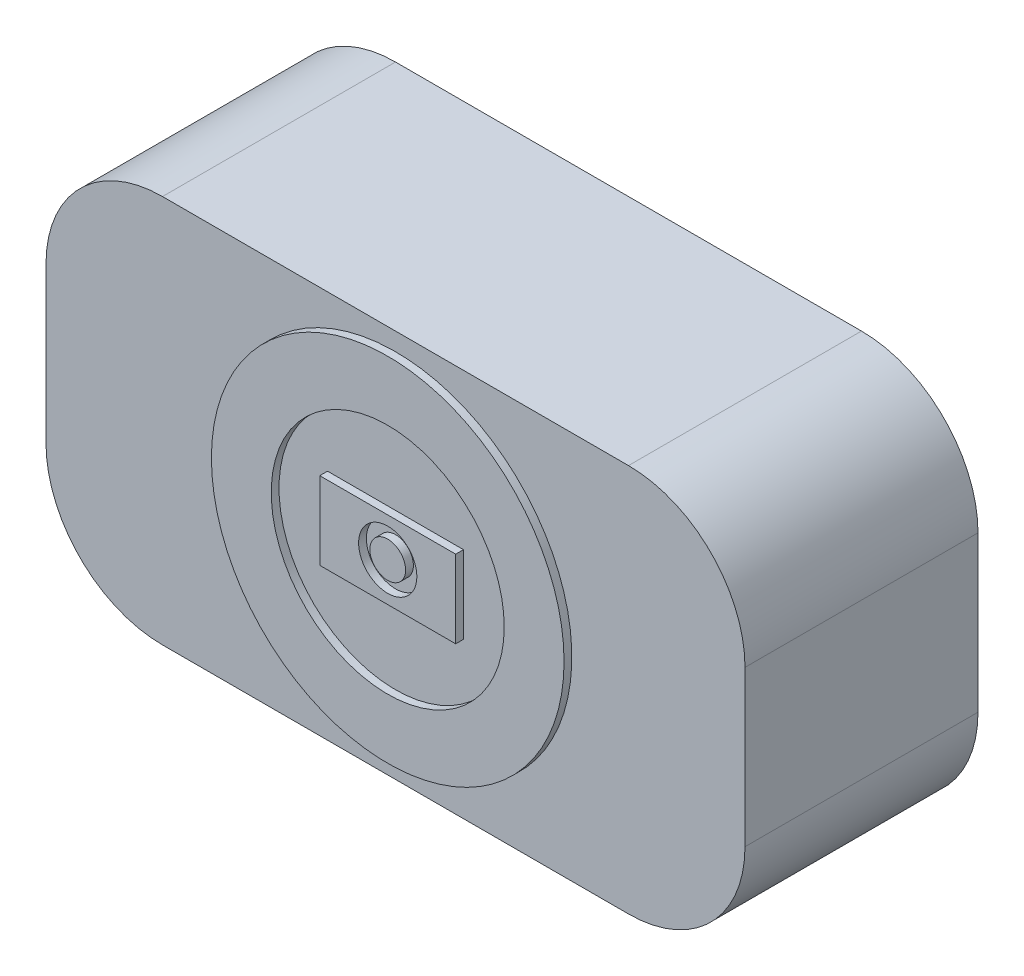
ISO-10303-21;
HEADER;
FILE_DESCRIPTION(('STEP AP214'),'2;1');
FILE_NAME('part.step','',(''),(''),'','','');
FILE_SCHEMA(('AUTOMOTIVE_DESIGN { 1 0 10303 214 1 1 1 1 }'));
ENDSEC;
DATA;
#1=APPLICATION_CONTEXT('core data for automotive mechanical design processes');
#2=APPLICATION_PROTOCOL_DEFINITION('international standard','automotive_design',2000,#1);
#3=PRODUCT_CONTEXT('',#1,'mechanical');
#4=PRODUCT('Part','Part','',(#3));
#5=PRODUCT_RELATED_PRODUCT_CATEGORY('part','',(#4));
#6=PRODUCT_DEFINITION_FORMATION('','',#4);
#7=PRODUCT_DEFINITION_CONTEXT('part definition',#1,'design');
#8=PRODUCT_DEFINITION('design','',#6,#7);
#9=PRODUCT_DEFINITION_SHAPE('','',#8);
#10=(LENGTH_UNIT() NAMED_UNIT(*) SI_UNIT(.MILLI.,.METRE.));
#11=(NAMED_UNIT(*) PLANE_ANGLE_UNIT() SI_UNIT($,.RADIAN.));
#12=(NAMED_UNIT(*) SI_UNIT($,.STERADIAN.) SOLID_ANGLE_UNIT());
#13=UNCERTAINTY_MEASURE_WITH_UNIT(LENGTH_MEASURE(1.E-05),#10,'distance_accuracy_value','');
#14=(GEOMETRIC_REPRESENTATION_CONTEXT(3) GLOBAL_UNCERTAINTY_ASSIGNED_CONTEXT((#13)) GLOBAL_UNIT_ASSIGNED_CONTEXT((#10,
#11,#12)) REPRESENTATION_CONTEXT('',''));
#15=CARTESIAN_POINT('',(0.,0.,0.));
#16=DIRECTION('',(0.,0.,1.));
#17=DIRECTION('',(1.,0.,0.));
#18=AXIS2_PLACEMENT_3D('',#15,#16,#17);
#19=CARTESIAN_POINT('',(45.,25.,0.));
#20=DIRECTION('',(0.,0.,1.));
#21=DIRECTION('',(1.,0.,0.));
#22=AXIS2_PLACEMENT_3D('',#19,#20,#21);
#23=PLANE('',#22);
#24=CARTESIAN_POINT('',(45.,25.,0.));
#25=DIRECTION('',(0.,0.,1.));
#26=DIRECTION('',(1.,0.,0.));
#27=AXIS2_PLACEMENT_3D('',#24,#25,#26);
#28=CIRCLE('',#27,3.75000000000001);
#29=CARTESIAN_POINT('',(48.75,25.,0.));
#30=VERTEX_POINT('',#29);
#31=EDGE_CURVE('E432',#30,#30,#28,.T.);
#32=ORIENTED_EDGE('',*,*,#31,.T.);
#33=EDGE_LOOP('',(#32));
#34=FACE_BOUND('',#33,.T.);
#35=CARTESIAN_POINT('',(45.,25.,0.));
#36=DIRECTION('',(0.,0.,1.));
#37=DIRECTION('',(1.,0.,0.));
#38=AXIS2_PLACEMENT_3D('',#35,#36,#37);
#39=CIRCLE('',#38,2.30333071039238);
#40=CARTESIAN_POINT('',(47.3033307103924,25.,0.));
#41=VERTEX_POINT('',#40);
#42=EDGE_CURVE('E429',#41,#41,#39,.T.);
#43=ORIENTED_EDGE('',*,*,#42,.F.);
#44=EDGE_LOOP('',(#43));
#45=FACE_BOUND('',#44,.T.);
#46=ADVANCED_FACE('F32',(#34,#45),#23,.T.);
#47=CARTESIAN_POINT('',(45.,25.,0.));
#48=DIRECTION('',(0.,0.,1.));
#49=DIRECTION('',(1.,0.,0.));
#50=AXIS2_PLACEMENT_3D('',#47,#48,#49);
#51=PLANE('',#50);
#52=CARTESIAN_POINT('',(45.,25.,0.));
#53=DIRECTION('',(0.,0.,1.));
#54=DIRECTION('',(1.,0.,0.));
#55=AXIS2_PLACEMENT_3D('',#52,#53,#54);
#56=CIRCLE('',#55,15.);
#57=CARTESIAN_POINT('',(60.,25.,0.));
#58=VERTEX_POINT('',#57);
#59=EDGE_CURVE('E151',#58,#58,#56,.T.);
#60=ORIENTED_EDGE('',*,*,#59,.T.);
#61=EDGE_LOOP('',(#60));
#62=FACE_BOUND('',#61,.T.);
#63=DIRECTION('',(1.,0.,0.));
#64=VECTOR('',#63,1.);
#65=CARTESIAN_POINT('',(36.25,20.,0.));
#66=LINE('',#65,#64);
#67=CARTESIAN_POINT('',(36.25,20.,0.));
#68=VERTEX_POINT('',#67);
#69=CARTESIAN_POINT('',(53.75,20.,0.));
#70=VERTEX_POINT('',#69);
#71=EDGE_CURVE('E442',#68,#70,#66,.T.);
#72=ORIENTED_EDGE('',*,*,#71,.F.);
#73=DIRECTION('',(0.,-1.,0.));
#74=VECTOR('',#73,1.);
#75=CARTESIAN_POINT('',(36.25,20.,0.));
#76=LINE('',#75,#74);
#77=CARTESIAN_POINT('',(36.25,30.,0.));
#78=VERTEX_POINT('',#77);
#79=EDGE_CURVE('E146',#78,#68,#76,.T.);
#80=ORIENTED_EDGE('',*,*,#79,.F.);
#81=DIRECTION('',(-1.,0.,0.));
#82=VECTOR('',#81,1.);
#83=CARTESIAN_POINT('',(36.25,30.,0.));
#84=LINE('',#83,#82);
#85=CARTESIAN_POINT('',(53.75,30.,0.));
#86=VERTEX_POINT('',#85);
#87=EDGE_CURVE('E142',#86,#78,#84,.T.);
#88=ORIENTED_EDGE('',*,*,#87,.F.);
#89=DIRECTION('',(0.,1.,0.));
#90=VECTOR('',#89,1.);
#91=CARTESIAN_POINT('',(53.75,20.,0.));
#92=LINE('',#91,#90);
#93=EDGE_CURVE('E444',#70,#86,#92,.T.);
#94=ORIENTED_EDGE('',*,*,#93,.F.);
#95=EDGE_LOOP('',(#72,#80,#88,#94));
#96=FACE_BOUND('',#95,.T.);
#97=ADVANCED_FACE('F260',(#62,#96),#51,.T.);
#98=CARTESIAN_POINT('',(0.,0.,0.));
#99=DIRECTION('',(0.,0.,-1.));
#100=DIRECTION('',(-1.,0.,0.));
#101=AXIS2_PLACEMENT_3D('',#98,#99,#100);
#102=PLANE('',#101);
#103=DIRECTION('',(1.,0.,0.));
#104=VECTOR('',#103,1.);
#105=CARTESIAN_POINT('',(0.,0.,0.));
#106=LINE('',#105,#104);
#107=CARTESIAN_POINT('',(15.,0.,0.));
#108=VERTEX_POINT('',#107);
#109=CARTESIAN_POINT('',(75.,0.,0.));
#110=VERTEX_POINT('',#109);
#111=EDGE_CURVE('E177',#108,#110,#106,.T.);
#112=ORIENTED_EDGE('',*,*,#111,.T.);
#113=CARTESIAN_POINT('',(75.,15.,0.));
#114=DIRECTION('',(0.,0.,-1.));
#115=DIRECTION('',(-1.,0.,0.));
#116=AXIS2_PLACEMENT_3D('',#113,#114,#115);
#117=CIRCLE('',#116,15.);
#118=CARTESIAN_POINT('',(90.,15.,0.));
#119=VERTEX_POINT('',#118);
#120=EDGE_CURVE('E195',#110,#119,#117,.F.);
#121=ORIENTED_EDGE('',*,*,#120,.T.);
#122=DIRECTION('',(0.,1.,0.));
#123=VECTOR('',#122,1.);
#124=CARTESIAN_POINT('',(90.,0.,0.));
#125=LINE('',#124,#123);
#126=CARTESIAN_POINT('',(90.,35.,0.));
#127=VERTEX_POINT('',#126);
#128=EDGE_CURVE('E180',#119,#127,#125,.T.);
#129=ORIENTED_EDGE('',*,*,#128,.T.);
#130=CARTESIAN_POINT('',(75.,35.,0.));
#131=DIRECTION('',(0.,0.,-1.));
#132=DIRECTION('',(-1.,0.,0.));
#133=AXIS2_PLACEMENT_3D('',#130,#131,#132);
#134=CIRCLE('',#133,15.);
#135=CARTESIAN_POINT('',(75.,50.,0.));
#136=VERTEX_POINT('',#135);
#137=EDGE_CURVE('E189',#127,#136,#134,.F.);
#138=ORIENTED_EDGE('',*,*,#137,.T.);
#139=DIRECTION('',(-1.,0.,0.));
#140=VECTOR('',#139,1.);
#141=CARTESIAN_POINT('',(0.,50.,0.));
#142=LINE('',#141,#140);
#143=CARTESIAN_POINT('',(15.,50.,0.));
#144=VERTEX_POINT('',#143);
#145=EDGE_CURVE('E166',#136,#144,#142,.T.);
#146=ORIENTED_EDGE('',*,*,#145,.T.);
#147=CARTESIAN_POINT('',(15.,35.,0.));
#148=DIRECTION('',(0.,0.,-1.));
#149=DIRECTION('',(-1.,0.,0.));
#150=AXIS2_PLACEMENT_3D('',#147,#148,#149);
#151=CIRCLE('',#150,15.);
#152=CARTESIAN_POINT('',(0.,35.,0.));
#153=VERTEX_POINT('',#152);
#154=EDGE_CURVE('E191',#144,#153,#151,.F.);
#155=ORIENTED_EDGE('',*,*,#154,.T.);
#156=DIRECTION('',(0.,-1.,0.));
#157=VECTOR('',#156,1.);
#158=CARTESIAN_POINT('',(0.,0.,0.));
#159=LINE('',#158,#157);
#160=CARTESIAN_POINT('',(0.,15.,0.));
#161=VERTEX_POINT('',#160);
#162=EDGE_CURVE('E161',#153,#161,#159,.T.);
#163=ORIENTED_EDGE('',*,*,#162,.T.);
#164=CARTESIAN_POINT('',(15.,15.,0.));
#165=DIRECTION('',(0.,0.,-1.));
#166=DIRECTION('',(-1.,0.,0.));
#167=AXIS2_PLACEMENT_3D('',#164,#165,#166);
#168=CIRCLE('',#167,15.);
#169=EDGE_CURVE('E193',#161,#108,#168,.F.);
#170=ORIENTED_EDGE('',*,*,#169,.T.);
#171=EDGE_LOOP('',(#112,#121,#129,#138,#146,#155,#163,#170));
#172=FACE_BOUND('',#171,.T.);
#173=CARTESIAN_POINT('',(45.,25.,0.));
#174=DIRECTION('',(0.,0.,-1.));
#175=DIRECTION('',(-1.,0.,0.));
#176=AXIS2_PLACEMENT_3D('',#173,#174,#175);
#177=CIRCLE('',#176,22.703438641427);
#178=CARTESIAN_POINT('',(22.296561358573,25.,0.));
#179=VERTEX_POINT('',#178);
#180=EDGE_CURVE('E11',#179,#179,#177,.F.);
#181=ORIENTED_EDGE('',*,*,#180,.F.);
#182=EDGE_LOOP('',(#181));
#183=FACE_BOUND('',#182,.T.);
#184=ADVANCED_FACE('F223',(#172,#183),#102,.F.);
#185=CARTESIAN_POINT('',(0.,0.,-30.));
#186=DIRECTION('',(-1.,0.,0.));
#187=DIRECTION('',(0.,0.,1.));
#188=AXIS2_PLACEMENT_3D('',#185,#186,#187);
#189=PLANE('',#188);
#190=DIRECTION('',(0.,-1.,0.));
#191=VECTOR('',#190,1.);
#192=CARTESIAN_POINT('',(0.,0.,-30.));
#193=LINE('',#192,#191);
#194=CARTESIAN_POINT('',(0.,35.,-30.));
#195=VERTEX_POINT('',#194);
#196=CARTESIAN_POINT('',(0.,15.,-30.));
#197=VERTEX_POINT('',#196);
#198=EDGE_CURVE('E162',#195,#197,#193,.T.);
#199=ORIENTED_EDGE('',*,*,#198,.T.);
#200=DIRECTION('',(0.,0.,1.));
#201=VECTOR('',#200,1.);
#202=CARTESIAN_POINT('',(0.,15.,-30.));
#203=LINE('',#202,#201);
#204=EDGE_CURVE('E211',#197,#161,#203,.T.);
#205=ORIENTED_EDGE('',*,*,#204,.T.);
#206=ORIENTED_EDGE('',*,*,#162,.F.);
#207=DIRECTION('',(0.,0.,1.));
#208=VECTOR('',#207,1.);
#209=CARTESIAN_POINT('',(0.,35.,-30.));
#210=LINE('',#209,#208);
#211=EDGE_CURVE('E209',#153,#195,#210,.F.);
#212=ORIENTED_EDGE('',*,*,#211,.T.);
#213=EDGE_LOOP('',(#199,#205,#206,#212));
#214=FACE_BOUND('',#213,.T.);
#215=ADVANCED_FACE('F249',(#214),#189,.T.);
#216=CARTESIAN_POINT('',(0.,50.,-30.));
#217=DIRECTION('',(0.,1.,0.));
#218=DIRECTION('',(0.,0.,1.));
#219=AXIS2_PLACEMENT_3D('',#216,#217,#218);
#220=PLANE('',#219);
#221=DIRECTION('',(-1.,0.,0.));
#222=VECTOR('',#221,1.);
#223=CARTESIAN_POINT('',(0.,50.,-30.));
#224=LINE('',#223,#222);
#225=CARTESIAN_POINT('',(75.,50.,-30.));
#226=VERTEX_POINT('',#225);
#227=CARTESIAN_POINT('',(15.,50.,-30.));
#228=VERTEX_POINT('',#227);
#229=EDGE_CURVE('E172',#226,#228,#224,.T.);
#230=ORIENTED_EDGE('',*,*,#229,.T.);
#231=DIRECTION('',(0.,0.,1.));
#232=VECTOR('',#231,1.);
#233=CARTESIAN_POINT('',(15.,50.,-30.));
#234=LINE('',#233,#232);
#235=EDGE_CURVE('E40',#228,#144,#234,.T.);
#236=ORIENTED_EDGE('',*,*,#235,.T.);
#237=ORIENTED_EDGE('',*,*,#145,.F.);
#238=DIRECTION('',(0.,0.,1.));
#239=VECTOR('',#238,1.);
#240=CARTESIAN_POINT('',(75.,50.,-30.));
#241=LINE('',#240,#239);
#242=EDGE_CURVE('E214',#136,#226,#241,.F.);
#243=ORIENTED_EDGE('',*,*,#242,.T.);
#244=EDGE_LOOP('',(#230,#236,#237,#243));
#245=FACE_BOUND('',#244,.T.);
#246=ADVANCED_FACE('F219',(#245),#220,.T.);
#247=CARTESIAN_POINT('',(90.,0.,-30.));
#248=DIRECTION('',(1.,0.,0.));
#249=DIRECTION('',(0.,0.,-1.));
#250=AXIS2_PLACEMENT_3D('',#247,#248,#249);
#251=PLANE('',#250);
#252=ORIENTED_EDGE('',*,*,#128,.F.);
#253=DIRECTION('',(0.,0.,1.));
#254=VECTOR('',#253,1.);
#255=CARTESIAN_POINT('',(90.,15.,-30.));
#256=LINE('',#255,#254);
#257=CARTESIAN_POINT('',(90.,15.,-30.));
#258=VERTEX_POINT('',#257);
#259=EDGE_CURVE('E200',#119,#258,#256,.F.);
#260=ORIENTED_EDGE('',*,*,#259,.T.);
#261=DIRECTION('',(0.,1.,0.));
#262=VECTOR('',#261,1.);
#263=CARTESIAN_POINT('',(90.,0.,-30.));
#264=LINE('',#263,#262);
#265=CARTESIAN_POINT('',(90.,35.,-30.));
#266=VERTEX_POINT('',#265);
#267=EDGE_CURVE('E169',#258,#266,#264,.T.);
#268=ORIENTED_EDGE('',*,*,#267,.T.);
#269=DIRECTION('',(0.,0.,1.));
#270=VECTOR('',#269,1.);
#271=CARTESIAN_POINT('',(90.,35.,-30.));
#272=LINE('',#271,#270);
#273=EDGE_CURVE('E197',#266,#127,#272,.T.);
#274=ORIENTED_EDGE('',*,*,#273,.T.);
#275=EDGE_LOOP('',(#252,#260,#268,#274));
#276=FACE_BOUND('',#275,.T.);
#277=ADVANCED_FACE('F231',(#276),#251,.T.);
#278=CARTESIAN_POINT('',(0.,0.,-30.));
#279=DIRECTION('',(0.,-1.,0.));
#280=DIRECTION('',(0.,0.,-1.));
#281=AXIS2_PLACEMENT_3D('',#278,#279,#280);
#282=PLANE('',#281);
#283=DIRECTION('',(1.,0.,0.));
#284=VECTOR('',#283,1.);
#285=CARTESIAN_POINT('',(0.,0.,-30.));
#286=LINE('',#285,#284);
#287=CARTESIAN_POINT('',(15.,0.,-30.));
#288=VERTEX_POINT('',#287);
#289=CARTESIAN_POINT('',(75.,0.,-30.));
#290=VERTEX_POINT('',#289);
#291=EDGE_CURVE('E165',#288,#290,#286,.T.);
#292=ORIENTED_EDGE('',*,*,#291,.T.);
#293=DIRECTION('',(0.,0.,1.));
#294=VECTOR('',#293,1.);
#295=CARTESIAN_POINT('',(75.,0.,-30.));
#296=LINE('',#295,#294);
#297=EDGE_CURVE('E186',#290,#110,#296,.T.);
#298=ORIENTED_EDGE('',*,*,#297,.T.);
#299=ORIENTED_EDGE('',*,*,#111,.F.);
#300=DIRECTION('',(0.,0.,1.));
#301=VECTOR('',#300,1.);
#302=CARTESIAN_POINT('',(15.,0.,-30.));
#303=LINE('',#302,#301);
#304=EDGE_CURVE('E174',#108,#288,#303,.F.);
#305=ORIENTED_EDGE('',*,*,#304,.T.);
#306=EDGE_LOOP('',(#292,#298,#299,#305));
#307=FACE_BOUND('',#306,.T.);
#308=ADVANCED_FACE('F242',(#307),#282,.T.);
#309=CARTESIAN_POINT('',(0.,0.,-30.));
#310=DIRECTION('',(0.,0.,-1.));
#311=DIRECTION('',(-1.,0.,0.));
#312=AXIS2_PLACEMENT_3D('',#309,#310,#311);
#313=PLANE('',#312);
#314=ORIENTED_EDGE('',*,*,#267,.F.);
#315=CARTESIAN_POINT('',(75.,15.,-30.));
#316=DIRECTION('',(0.,0.,-1.));
#317=DIRECTION('',(-1.,0.,0.));
#318=AXIS2_PLACEMENT_3D('',#315,#316,#317);
#319=CIRCLE('',#318,15.);
#320=EDGE_CURVE('E207',#258,#290,#319,.T.);
#321=ORIENTED_EDGE('',*,*,#320,.T.);
#322=ORIENTED_EDGE('',*,*,#291,.F.);
#323=CARTESIAN_POINT('',(15.,15.,-30.));
#324=DIRECTION('',(0.,0.,-1.));
#325=DIRECTION('',(-1.,0.,0.));
#326=AXIS2_PLACEMENT_3D('',#323,#324,#325);
#327=CIRCLE('',#326,15.);
#328=EDGE_CURVE('E205',#288,#197,#327,.T.);
#329=ORIENTED_EDGE('',*,*,#328,.T.);
#330=ORIENTED_EDGE('',*,*,#198,.F.);
#331=CARTESIAN_POINT('',(15.,35.,-30.));
#332=DIRECTION('',(0.,0.,-1.));
#333=DIRECTION('',(-1.,0.,0.));
#334=AXIS2_PLACEMENT_3D('',#331,#332,#333);
#335=CIRCLE('',#334,15.);
#336=EDGE_CURVE('E55',#195,#228,#335,.T.);
#337=ORIENTED_EDGE('',*,*,#336,.T.);
#338=ORIENTED_EDGE('',*,*,#229,.F.);
#339=CARTESIAN_POINT('',(75.,35.,-30.));
#340=DIRECTION('',(0.,0.,-1.));
#341=DIRECTION('',(-1.,0.,0.));
#342=AXIS2_PLACEMENT_3D('',#339,#340,#341);
#343=CIRCLE('',#342,15.);
#344=EDGE_CURVE('E202',#226,#266,#343,.T.);
#345=ORIENTED_EDGE('',*,*,#344,.T.);
#346=EDGE_LOOP('',(#314,#321,#322,#329,#330,#337,#338,#345));
#347=FACE_BOUND('',#346,.T.);
#348=ADVANCED_FACE('F235',(#347),#313,.T.);
#349=CARTESIAN_POINT('',(75.,15.,-30.));
#350=DIRECTION('',(0.,0.,1.));
#351=DIRECTION('',(1.,0.,0.));
#352=AXIS2_PLACEMENT_3D('',#349,#350,#351);
#353=CYLINDRICAL_SURFACE('',#352,15.);
#354=ORIENTED_EDGE('',*,*,#320,.F.);
#355=ORIENTED_EDGE('',*,*,#259,.F.);
#356=ORIENTED_EDGE('',*,*,#120,.F.);
#357=ORIENTED_EDGE('',*,*,#297,.F.);
#358=EDGE_LOOP('',(#354,#355,#356,#357));
#359=FACE_BOUND('',#358,.T.);
#360=ADVANCED_FACE('F239',(#359),#353,.T.);
#361=CARTESIAN_POINT('',(15.,15.,-30.));
#362=DIRECTION('',(0.,0.,1.));
#363=DIRECTION('',(1.,0.,0.));
#364=AXIS2_PLACEMENT_3D('',#361,#362,#363);
#365=CYLINDRICAL_SURFACE('',#364,15.);
#366=ORIENTED_EDGE('',*,*,#328,.F.);
#367=ORIENTED_EDGE('',*,*,#304,.F.);
#368=ORIENTED_EDGE('',*,*,#169,.F.);
#369=ORIENTED_EDGE('',*,*,#204,.F.);
#370=EDGE_LOOP('',(#366,#367,#368,#369));
#371=FACE_BOUND('',#370,.T.);
#372=ADVANCED_FACE('F247',(#371),#365,.T.);
#373=CARTESIAN_POINT('',(15.,35.,-30.));
#374=DIRECTION('',(0.,0.,1.));
#375=DIRECTION('',(1.,0.,0.));
#376=AXIS2_PLACEMENT_3D('',#373,#374,#375);
#377=CYLINDRICAL_SURFACE('',#376,15.);
#378=ORIENTED_EDGE('',*,*,#336,.F.);
#379=ORIENTED_EDGE('',*,*,#211,.F.);
#380=ORIENTED_EDGE('',*,*,#154,.F.);
#381=ORIENTED_EDGE('',*,*,#235,.F.);
#382=EDGE_LOOP('',(#378,#379,#380,#381));
#383=FACE_BOUND('',#382,.T.);
#384=ADVANCED_FACE('F251',(#383),#377,.T.);
#385=CARTESIAN_POINT('',(75.,35.,-30.));
#386=DIRECTION('',(0.,0.,1.));
#387=DIRECTION('',(1.,0.,0.));
#388=AXIS2_PLACEMENT_3D('',#385,#386,#387);
#389=CYLINDRICAL_SURFACE('',#388,15.);
#390=ORIENTED_EDGE('',*,*,#344,.F.);
#391=ORIENTED_EDGE('',*,*,#242,.F.);
#392=ORIENTED_EDGE('',*,*,#137,.F.);
#393=ORIENTED_EDGE('',*,*,#273,.F.);
#394=EDGE_LOOP('',(#390,#391,#392,#393));
#395=FACE_BOUND('',#394,.T.);
#396=ADVANCED_FACE('F34',(#395),#389,.T.);
#397=CARTESIAN_POINT('',(45.,25.,1.));
#398=DIRECTION('',(0.,0.,-1.));
#399=DIRECTION('',(-1.,0.,0.));
#400=AXIS2_PLACEMENT_3D('',#397,#398,#399);
#401=CYLINDRICAL_SURFACE('',#400,22.703438641427);
#402=CARTESIAN_POINT('',(45.,25.,1.));
#403=DIRECTION('',(0.,0.,1.));
#404=DIRECTION('',(1.,0.,0.));
#405=AXIS2_PLACEMENT_3D('',#402,#403,#404);
#406=CIRCLE('',#405,22.703438641427);
#407=CARTESIAN_POINT('',(67.7034386414269,25.,1.));
#408=VERTEX_POINT('',#407);
#409=EDGE_CURVE('E157',#408,#408,#406,.T.);
#410=ORIENTED_EDGE('',*,*,#409,.F.);
#411=EDGE_LOOP('',(#410));
#412=FACE_BOUND('',#411,.T.);
#413=ORIENTED_EDGE('',*,*,#180,.T.);
#414=EDGE_LOOP('',(#413));
#415=FACE_BOUND('',#414,.T.);
#416=ADVANCED_FACE('F257',(#412,#415),#401,.T.);
#417=CARTESIAN_POINT('',(45.,25.,1.));
#418=DIRECTION('',(0.,0.,1.));
#419=DIRECTION('',(1.,0.,0.));
#420=AXIS2_PLACEMENT_3D('',#417,#418,#419);
#421=PLANE('',#420);
#422=CARTESIAN_POINT('',(45.,25.,1.));
#423=DIRECTION('',(0.,0.,1.));
#424=DIRECTION('',(1.,0.,0.));
#425=AXIS2_PLACEMENT_3D('',#422,#423,#424);
#426=CIRCLE('',#425,15.);
#427=CARTESIAN_POINT('',(60.,25.,1.));
#428=VERTEX_POINT('',#427);
#429=EDGE_CURVE('E148',#428,#428,#426,.T.);
#430=ORIENTED_EDGE('',*,*,#429,.F.);
#431=EDGE_LOOP('',(#430));
#432=FACE_BOUND('',#431,.T.);
#433=ORIENTED_EDGE('',*,*,#409,.T.);
#434=EDGE_LOOP('',(#433));
#435=FACE_BOUND('',#434,.T.);
#436=ADVANCED_FACE('F295',(#432,#435),#421,.T.);
#437=CARTESIAN_POINT('',(45.,25.,0.));
#438=DIRECTION('',(0.,0.,1.));
#439=DIRECTION('',(1.,0.,0.));
#440=AXIS2_PLACEMENT_3D('',#437,#438,#439);
#441=CYLINDRICAL_SURFACE('',#440,15.);
#442=ORIENTED_EDGE('',*,*,#59,.F.);
#443=EDGE_LOOP('',(#442));
#444=FACE_BOUND('',#443,.T.);
#445=ORIENTED_EDGE('',*,*,#429,.T.);
#446=EDGE_LOOP('',(#445));
#447=FACE_BOUND('',#446,.T.);
#448=ADVANCED_FACE('F291',(#444,#447),#441,.F.);
#449=CARTESIAN_POINT('',(36.25,20.,1.));
#450=DIRECTION('',(1.,0.,0.));
#451=DIRECTION('',(0.,0.,-1.));
#452=AXIS2_PLACEMENT_3D('',#449,#450,#451);
#453=PLANE('',#452);
#454=ORIENTED_EDGE('',*,*,#79,.T.);
#455=DIRECTION('',(0.,0.,-1.));
#456=VECTOR('',#455,1.);
#457=CARTESIAN_POINT('',(36.25,20.,1.));
#458=LINE('',#457,#456);
#459=CARTESIAN_POINT('',(36.25,20.,1.));
#460=VERTEX_POINT('',#459);
#461=EDGE_CURVE('E127',#460,#68,#458,.T.);
#462=ORIENTED_EDGE('',*,*,#461,.F.);
#463=DIRECTION('',(0.,-1.,0.));
#464=VECTOR('',#463,1.);
#465=CARTESIAN_POINT('',(36.25,20.,1.));
#466=LINE('',#465,#464);
#467=CARTESIAN_POINT('',(36.25,30.,1.));
#468=VERTEX_POINT('',#467);
#469=EDGE_CURVE('E134',#468,#460,#466,.T.);
#470=ORIENTED_EDGE('',*,*,#469,.F.);
#471=DIRECTION('',(0.,0.,-1.));
#472=VECTOR('',#471,1.);
#473=CARTESIAN_POINT('',(36.25,30.,1.));
#474=LINE('',#473,#472);
#475=EDGE_CURVE('E440',#468,#78,#474,.T.);
#476=ORIENTED_EDGE('',*,*,#475,.T.);
#477=EDGE_LOOP('',(#454,#462,#470,#476));
#478=FACE_BOUND('',#477,.T.);
#479=ADVANCED_FACE('F144',(#478),#453,.F.);
#480=CARTESIAN_POINT('',(36.25,20.,1.));
#481=DIRECTION('',(0.,1.,0.));
#482=DIRECTION('',(0.,0.,1.));
#483=AXIS2_PLACEMENT_3D('',#480,#481,#482);
#484=PLANE('',#483);
#485=ORIENTED_EDGE('',*,*,#71,.T.);
#486=DIRECTION('',(0.,0.,-1.));
#487=VECTOR('',#486,1.);
#488=CARTESIAN_POINT('',(53.75,20.,1.));
#489=LINE('',#488,#487);
#490=CARTESIAN_POINT('',(53.75,20.,1.));
#491=VERTEX_POINT('',#490);
#492=EDGE_CURVE('E130',#491,#70,#489,.T.);
#493=ORIENTED_EDGE('',*,*,#492,.F.);
#494=DIRECTION('',(1.,0.,0.));
#495=VECTOR('',#494,1.);
#496=CARTESIAN_POINT('',(36.25,20.,1.));
#497=LINE('',#496,#495);
#498=EDGE_CURVE('E123',#460,#491,#497,.T.);
#499=ORIENTED_EDGE('',*,*,#498,.F.);
#500=ORIENTED_EDGE('',*,*,#461,.T.);
#501=EDGE_LOOP('',(#485,#493,#499,#500));
#502=FACE_BOUND('',#501,.T.);
#503=ADVANCED_FACE('F125',(#502),#484,.F.);
#504=CARTESIAN_POINT('',(53.75,20.,1.));
#505=DIRECTION('',(-1.,0.,0.));
#506=DIRECTION('',(0.,0.,1.));
#507=AXIS2_PLACEMENT_3D('',#504,#505,#506);
#508=PLANE('',#507);
#509=ORIENTED_EDGE('',*,*,#93,.T.);
#510=DIRECTION('',(0.,0.,-1.));
#511=VECTOR('',#510,1.);
#512=CARTESIAN_POINT('',(53.75,30.,1.));
#513=LINE('',#512,#511);
#514=CARTESIAN_POINT('',(53.75,30.,1.));
#515=VERTEX_POINT('',#514);
#516=EDGE_CURVE('E47',#515,#86,#513,.T.);
#517=ORIENTED_EDGE('',*,*,#516,.F.);
#518=DIRECTION('',(0.,1.,0.));
#519=VECTOR('',#518,1.);
#520=CARTESIAN_POINT('',(53.75,20.,1.));
#521=LINE('',#520,#519);
#522=EDGE_CURVE('E133',#491,#515,#521,.T.);
#523=ORIENTED_EDGE('',*,*,#522,.F.);
#524=ORIENTED_EDGE('',*,*,#492,.T.);
#525=EDGE_LOOP('',(#509,#517,#523,#524));
#526=FACE_BOUND('',#525,.T.);
#527=ADVANCED_FACE('F284',(#526),#508,.F.);
#528=CARTESIAN_POINT('',(36.25,30.,1.));
#529=DIRECTION('',(0.,-1.,0.));
#530=DIRECTION('',(1.,0.,0.));
#531=AXIS2_PLACEMENT_3D('',#528,#529,#530);
#532=PLANE('',#531);
#533=ORIENTED_EDGE('',*,*,#87,.T.);
#534=ORIENTED_EDGE('',*,*,#475,.F.);
#535=DIRECTION('',(-1.,0.,0.));
#536=VECTOR('',#535,1.);
#537=CARTESIAN_POINT('',(36.25,30.,1.));
#538=LINE('',#537,#536);
#539=EDGE_CURVE('E138',#515,#468,#538,.T.);
#540=ORIENTED_EDGE('',*,*,#539,.F.);
#541=ORIENTED_EDGE('',*,*,#516,.T.);
#542=EDGE_LOOP('',(#533,#534,#540,#541));
#543=FACE_BOUND('',#542,.T.);
#544=ADVANCED_FACE('F280',(#543),#532,.F.);
#545=CARTESIAN_POINT('',(0.,0.,1.));
#546=DIRECTION('',(0.,0.,-1.));
#547=DIRECTION('',(-1.,0.,0.));
#548=AXIS2_PLACEMENT_3D('',#545,#546,#547);
#549=PLANE('',#548);
#550=CARTESIAN_POINT('',(45.,25.,1.));
#551=DIRECTION('',(0.,0.,1.));
#552=DIRECTION('',(1.,0.,0.));
#553=AXIS2_PLACEMENT_3D('',#550,#551,#552);
#554=CIRCLE('',#553,3.75000000000001);
#555=CARTESIAN_POINT('',(48.75,25.,1.));
#556=VERTEX_POINT('',#555);
#557=EDGE_CURVE('E428',#556,#556,#554,.T.);
#558=ORIENTED_EDGE('',*,*,#557,.F.);
#559=EDGE_LOOP('',(#558));
#560=FACE_BOUND('',#559,.T.);
#561=ORIENTED_EDGE('',*,*,#469,.T.);
#562=ORIENTED_EDGE('',*,*,#498,.T.);
#563=ORIENTED_EDGE('',*,*,#522,.T.);
#564=ORIENTED_EDGE('',*,*,#539,.T.);
#565=EDGE_LOOP('',(#561,#562,#563,#564));
#566=FACE_BOUND('',#565,.T.);
#567=ADVANCED_FACE('F137',(#560,#566),#549,.F.);
#568=CARTESIAN_POINT('',(45.,25.,0.));
#569=DIRECTION('',(0.,0.,1.));
#570=DIRECTION('',(1.,0.,0.));
#571=AXIS2_PLACEMENT_3D('',#568,#569,#570);
#572=CYLINDRICAL_SURFACE('',#571,3.75000000000001);
#573=ORIENTED_EDGE('',*,*,#31,.F.);
#574=EDGE_LOOP('',(#573));
#575=FACE_BOUND('',#574,.T.);
#576=ORIENTED_EDGE('',*,*,#557,.T.);
#577=EDGE_LOOP('',(#576));
#578=FACE_BOUND('',#577,.T.);
#579=ADVANCED_FACE('F274',(#575,#578),#572,.F.);
#580=CARTESIAN_POINT('',(45.,25.,1.));
#581=DIRECTION('',(0.,0.,-1.));
#582=DIRECTION('',(-1.,0.,0.));
#583=AXIS2_PLACEMENT_3D('',#580,#581,#582);
#584=CYLINDRICAL_SURFACE('',#583,2.30333071039238);
#585=CARTESIAN_POINT('',(45.,25.,1.));
#586=DIRECTION('',(0.,0.,1.));
#587=DIRECTION('',(1.,0.,0.));
#588=AXIS2_PLACEMENT_3D('',#585,#586,#587);
#589=CIRCLE('',#588,2.30333071039238);
#590=CARTESIAN_POINT('',(47.3033307103924,25.,1.));
#591=VERTEX_POINT('',#590);
#592=EDGE_CURVE('E427',#591,#591,#589,.T.);
#593=ORIENTED_EDGE('',*,*,#592,.F.);
#594=EDGE_LOOP('',(#593));
#595=FACE_BOUND('',#594,.T.);
#596=ORIENTED_EDGE('',*,*,#42,.T.);
#597=EDGE_LOOP('',(#596));
#598=FACE_BOUND('',#597,.T.);
#599=ADVANCED_FACE('F272',(#595,#598),#584,.T.);
#600=CARTESIAN_POINT('',(45.,25.,1.));
#601=DIRECTION('',(0.,0.,1.));
#602=DIRECTION('',(1.,0.,0.));
#603=AXIS2_PLACEMENT_3D('',#600,#601,#602);
#604=PLANE('',#603);
#605=ORIENTED_EDGE('',*,*,#592,.T.);
#606=EDGE_LOOP('',(#605));
#607=FACE_BOUND('',#606,.T.);
#608=ADVANCED_FACE('F413',(#607),#604,.T.);
#609=CLOSED_SHELL('',(#46,#97,#184,#215,#246,#277,#308,#348,#360,#372,#384,#396,#416,#436,#448,
#479,#503,#527,#544,#567,#579,#599,#608));
#610=MANIFOLD_SOLID_BREP('B2',#609);
#611=ADVANCED_BREP_SHAPE_REPRESENTATION('',(#18,#610),#14);
#612=SHAPE_DEFINITION_REPRESENTATION(#9,#611);
ENDSEC;
END-ISO-10303-21;
